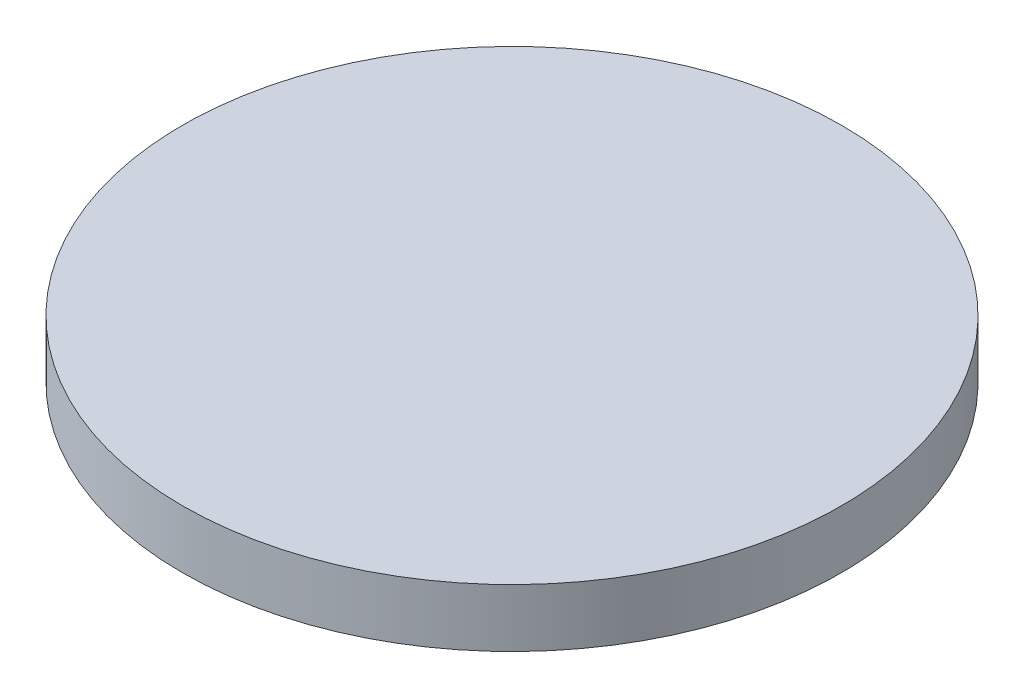
ISO-10303-21;
HEADER;
FILE_DESCRIPTION(('STEP AP214'),'2;1');
FILE_NAME('part.step','',(''),(''),'','','');
FILE_SCHEMA(('AUTOMOTIVE_DESIGN { 1 0 10303 214 1 1 1 1 }'));
ENDSEC;
DATA;
#1=APPLICATION_CONTEXT('core data for automotive mechanical design processes');
#2=APPLICATION_PROTOCOL_DEFINITION('international standard','automotive_design',2000,#1);
#3=PRODUCT_CONTEXT('',#1,'mechanical');
#4=PRODUCT('Part','Part','',(#3));
#5=PRODUCT_RELATED_PRODUCT_CATEGORY('part','',(#4));
#6=PRODUCT_DEFINITION_FORMATION('','',#4);
#7=PRODUCT_DEFINITION_CONTEXT('part definition',#1,'design');
#8=PRODUCT_DEFINITION('design','',#6,#7);
#9=PRODUCT_DEFINITION_SHAPE('','',#8);
#10=(LENGTH_UNIT() NAMED_UNIT(*) SI_UNIT(.MILLI.,.METRE.));
#11=(NAMED_UNIT(*) PLANE_ANGLE_UNIT() SI_UNIT($,.RADIAN.));
#12=(NAMED_UNIT(*) SI_UNIT($,.STERADIAN.) SOLID_ANGLE_UNIT());
#13=UNCERTAINTY_MEASURE_WITH_UNIT(LENGTH_MEASURE(1.E-05),#10,'distance_accuracy_value','');
#14=(GEOMETRIC_REPRESENTATION_CONTEXT(3) GLOBAL_UNCERTAINTY_ASSIGNED_CONTEXT((#13)) GLOBAL_UNIT_ASSIGNED_CONTEXT((#10,
#11,#12)) REPRESENTATION_CONTEXT('',''));
#15=CARTESIAN_POINT('',(0.,0.,0.));
#16=DIRECTION('',(0.,0.,1.));
#17=DIRECTION('',(1.,0.,0.));
#18=AXIS2_PLACEMENT_3D('',#15,#16,#17);
#19=CARTESIAN_POINT('',(0.,1.1,0.));
#20=DIRECTION('',(0.,-1.,0.));
#21=DIRECTION('',(0.,0.,-1.));
#22=AXIS2_PLACEMENT_3D('',#19,#20,#21);
#23=CYLINDRICAL_SURFACE('',#22,6.25);
#24=CARTESIAN_POINT('',(0.,1.1,0.));
#25=DIRECTION('',(0.,1.,0.));
#26=DIRECTION('',(0.,0.,1.));
#27=AXIS2_PLACEMENT_3D('',#24,#25,#26);
#28=CIRCLE('',#27,6.25);
#29=CARTESIAN_POINT('',(0.,1.1,6.25));
#30=VERTEX_POINT('',#29);
#31=EDGE_CURVE('E10',#30,#30,#28,.T.);
#32=ORIENTED_EDGE('',*,*,#31,.F.);
#33=EDGE_LOOP('',(#32));
#34=FACE_BOUND('',#33,.T.);
#35=CARTESIAN_POINT('',(0.,0.,0.));
#36=DIRECTION('',(0.,1.,0.));
#37=DIRECTION('',(0.,0.,1.));
#38=AXIS2_PLACEMENT_3D('',#35,#36,#37);
#39=CIRCLE('',#38,6.25);
#40=CARTESIAN_POINT('',(0.,0.,6.25));
#41=VERTEX_POINT('',#40);
#42=EDGE_CURVE('E35',#41,#41,#39,.T.);
#43=ORIENTED_EDGE('',*,*,#42,.T.);
#44=EDGE_LOOP('',(#43));
#45=FACE_BOUND('',#44,.T.);
#46=ADVANCED_FACE('F32',(#34,#45),#23,.T.);
#47=CARTESIAN_POINT('',(0.,1.1,0.));
#48=DIRECTION('',(0.,1.,0.));
#49=DIRECTION('',(0.,0.,1.));
#50=AXIS2_PLACEMENT_3D('',#47,#48,#49);
#51=PLANE('',#50);
#52=ORIENTED_EDGE('',*,*,#31,.T.);
#53=EDGE_LOOP('',(#52));
#54=FACE_BOUND('',#53,.T.);
#55=ADVANCED_FACE('F47',(#54),#51,.T.);
#56=CARTESIAN_POINT('',(0.,0.,0.));
#57=DIRECTION('',(0.,1.,0.));
#58=DIRECTION('',(0.,0.,1.));
#59=AXIS2_PLACEMENT_3D('',#56,#57,#58);
#60=PLANE('',#59);
#61=ORIENTED_EDGE('',*,*,#42,.F.);
#62=EDGE_LOOP('',(#61));
#63=FACE_BOUND('',#62,.T.);
#64=ADVANCED_FACE('F45',(#63),#60,.F.);
#65=CLOSED_SHELL('',(#46,#55,#64));
#66=MANIFOLD_SOLID_BREP('B2',#65);
#67=ADVANCED_BREP_SHAPE_REPRESENTATION('',(#18,#66),#14);
#68=SHAPE_DEFINITION_REPRESENTATION(#9,#67);
ENDSEC;
END-ISO-10303-21;
